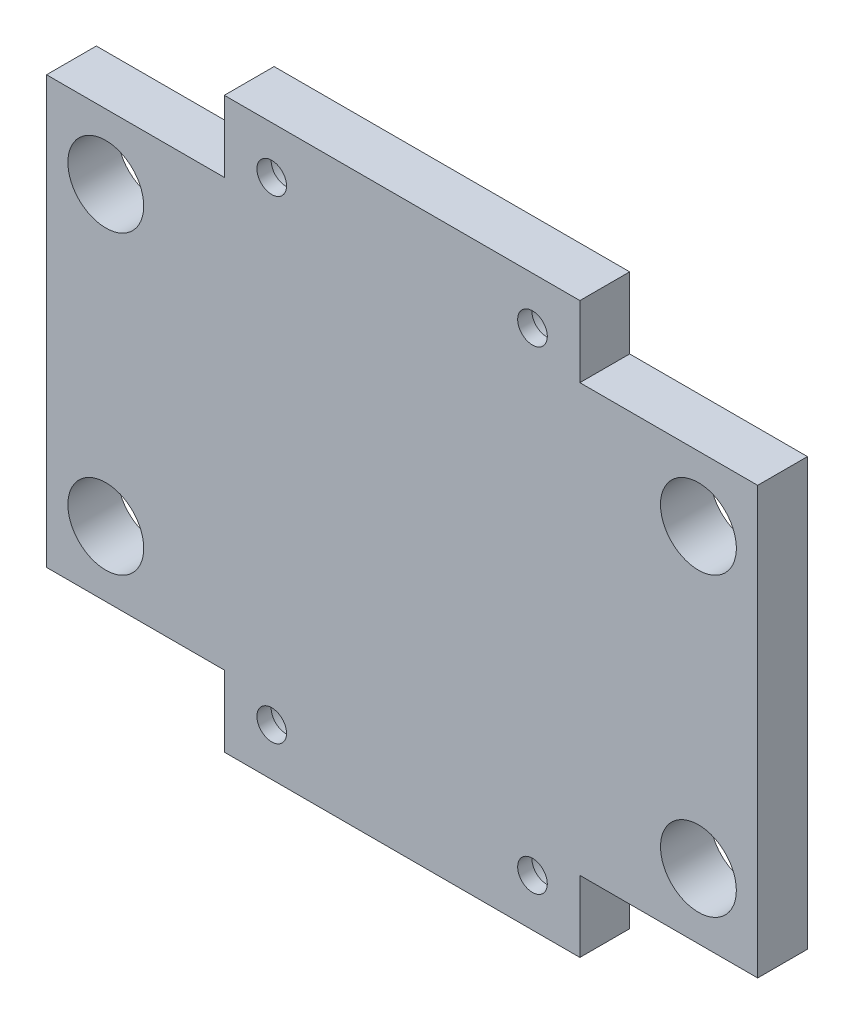
ISO-10303-21;
HEADER;
FILE_DESCRIPTION(('STEP AP214'),'2;1');
FILE_NAME('part.step','',(''),(''),'','','');
FILE_SCHEMA(('AUTOMOTIVE_DESIGN { 1 0 10303 214 1 1 1 1 }'));
ENDSEC;
DATA;
#1=APPLICATION_CONTEXT('core data for automotive mechanical design processes');
#2=APPLICATION_PROTOCOL_DEFINITION('international standard','automotive_design',2000,#1);
#3=PRODUCT_CONTEXT('',#1,'mechanical');
#4=PRODUCT('Part','Part','',(#3));
#5=PRODUCT_RELATED_PRODUCT_CATEGORY('part','',(#4));
#6=PRODUCT_DEFINITION_FORMATION('','',#4);
#7=PRODUCT_DEFINITION_CONTEXT('part definition',#1,'design');
#8=PRODUCT_DEFINITION('design','',#6,#7);
#9=PRODUCT_DEFINITION_SHAPE('','',#8);
#10=(LENGTH_UNIT() NAMED_UNIT(*) SI_UNIT(.MILLI.,.METRE.));
#11=(NAMED_UNIT(*) PLANE_ANGLE_UNIT() SI_UNIT($,.RADIAN.));
#12=(NAMED_UNIT(*) SI_UNIT($,.STERADIAN.) SOLID_ANGLE_UNIT());
#13=UNCERTAINTY_MEASURE_WITH_UNIT(LENGTH_MEASURE(1.E-05),#10,'distance_accuracy_value','');
#14=(GEOMETRIC_REPRESENTATION_CONTEXT(3) GLOBAL_UNCERTAINTY_ASSIGNED_CONTEXT((#13)) GLOBAL_UNIT_ASSIGNED_CONTEXT((#10,
#11,#12)) REPRESENTATION_CONTEXT('',''));
#15=CARTESIAN_POINT('',(0.,0.,0.));
#16=DIRECTION('',(0.,0.,1.));
#17=DIRECTION('',(1.,0.,0.));
#18=AXIS2_PLACEMENT_3D('',#15,#16,#17);
#19=CARTESIAN_POINT('',(-11.,20.,4.2));
#20=DIRECTION('',(0.,0.,-1.));
#21=DIRECTION('',(-1.,0.,0.));
#22=AXIS2_PLACEMENT_3D('',#19,#20,#21);
#23=CYLINDRICAL_SURFACE('',#22,1.25);
#24=CARTESIAN_POINT('',(-11.,20.,4.2));
#25=DIRECTION('',(0.,0.,1.));
#26=DIRECTION('',(1.,0.,0.));
#27=AXIS2_PLACEMENT_3D('',#24,#25,#26);
#28=CIRCLE('',#27,1.25);
#29=CARTESIAN_POINT('',(-9.75,20.,4.2));
#30=VERTEX_POINT('',#29);
#31=EDGE_CURVE('E254',#30,#30,#28,.T.);
#32=ORIENTED_EDGE('',*,*,#31,.T.);
#33=EDGE_LOOP('',(#32));
#34=FACE_BOUND('',#33,.T.);
#35=CARTESIAN_POINT('',(-11.,20.,3.));
#36=DIRECTION('',(0.,0.,-1.));
#37=DIRECTION('',(-1.,0.,0.));
#38=AXIS2_PLACEMENT_3D('',#35,#36,#37);
#39=CIRCLE('',#38,1.25);
#40=CARTESIAN_POINT('',(-12.25,20.,3.));
#41=VERTEX_POINT('',#40);
#42=EDGE_CURVE('E37',#41,#41,#39,.T.);
#43=ORIENTED_EDGE('',*,*,#42,.T.);
#44=EDGE_LOOP('',(#43));
#45=FACE_BOUND('',#44,.T.);
#46=ADVANCED_FACE('F33',(#34,#45),#23,.F.);
#47=CARTESIAN_POINT('',(-11.,-20.,4.2));
#48=DIRECTION('',(0.,0.,-1.));
#49=DIRECTION('',(-1.,0.,0.));
#50=AXIS2_PLACEMENT_3D('',#47,#48,#49);
#51=CYLINDRICAL_SURFACE('',#50,1.25);
#52=CARTESIAN_POINT('',(-11.,-20.,4.2));
#53=DIRECTION('',(0.,0.,1.));
#54=DIRECTION('',(-1.,0.,0.));
#55=AXIS2_PLACEMENT_3D('',#52,#53,#54);
#56=CIRCLE('',#55,1.25);
#57=CARTESIAN_POINT('',(-12.25,-20.,4.2));
#58=VERTEX_POINT('',#57);
#59=EDGE_CURVE('E249',#58,#58,#56,.T.);
#60=ORIENTED_EDGE('',*,*,#59,.T.);
#61=EDGE_LOOP('',(#60));
#62=FACE_BOUND('',#61,.T.);
#63=CARTESIAN_POINT('',(-11.,-20.,3.));
#64=DIRECTION('',(0.,0.,-1.));
#65=DIRECTION('',(-1.,0.,0.));
#66=AXIS2_PLACEMENT_3D('',#63,#64,#65);
#67=CIRCLE('',#66,1.25);
#68=CARTESIAN_POINT('',(-12.25,-20.,3.));
#69=VERTEX_POINT('',#68);
#70=EDGE_CURVE('E211',#69,#69,#67,.T.);
#71=ORIENTED_EDGE('',*,*,#70,.T.);
#72=EDGE_LOOP('',(#71));
#73=FACE_BOUND('',#72,.T.);
#74=ADVANCED_FACE('F307',(#62,#73),#51,.F.);
#75=CARTESIAN_POINT('',(11.,-20.,4.2));
#76=DIRECTION('',(0.,0.,-1.));
#77=DIRECTION('',(-1.,0.,0.));
#78=AXIS2_PLACEMENT_3D('',#75,#76,#77);
#79=CYLINDRICAL_SURFACE('',#78,1.25);
#80=CARTESIAN_POINT('',(11.,-20.,4.2));
#81=DIRECTION('',(0.,0.,1.));
#82=DIRECTION('',(1.,0.,0.));
#83=AXIS2_PLACEMENT_3D('',#80,#81,#82);
#84=CIRCLE('',#83,1.25);
#85=CARTESIAN_POINT('',(12.25,-20.,4.2));
#86=VERTEX_POINT('',#85);
#87=EDGE_CURVE('E236',#86,#86,#84,.T.);
#88=ORIENTED_EDGE('',*,*,#87,.T.);
#89=EDGE_LOOP('',(#88));
#90=FACE_BOUND('',#89,.T.);
#91=CARTESIAN_POINT('',(11.,-20.,3.));
#92=DIRECTION('',(0.,0.,-1.));
#93=DIRECTION('',(-1.,0.,0.));
#94=AXIS2_PLACEMENT_3D('',#91,#92,#93);
#95=CIRCLE('',#94,1.25);
#96=CARTESIAN_POINT('',(9.75,-20.,3.));
#97=VERTEX_POINT('',#96);
#98=EDGE_CURVE('E209',#97,#97,#95,.T.);
#99=ORIENTED_EDGE('',*,*,#98,.T.);
#100=EDGE_LOOP('',(#99));
#101=FACE_BOUND('',#100,.T.);
#102=ADVANCED_FACE('F313',(#90,#101),#79,.F.);
#103=CARTESIAN_POINT('',(11.,20.,4.2));
#104=DIRECTION('',(0.,0.,-1.));
#105=DIRECTION('',(-1.,0.,0.));
#106=AXIS2_PLACEMENT_3D('',#103,#104,#105);
#107=CYLINDRICAL_SURFACE('',#106,1.25);
#108=CARTESIAN_POINT('',(11.,20.,4.2));
#109=DIRECTION('',(0.,0.,1.));
#110=DIRECTION('',(-1.,0.,0.));
#111=AXIS2_PLACEMENT_3D('',#108,#109,#110);
#112=CIRCLE('',#111,1.25);
#113=CARTESIAN_POINT('',(9.75,20.,4.2));
#114=VERTEX_POINT('',#113);
#115=EDGE_CURVE('E231',#114,#114,#112,.T.);
#116=ORIENTED_EDGE('',*,*,#115,.T.);
#117=EDGE_LOOP('',(#116));
#118=FACE_BOUND('',#117,.T.);
#119=CARTESIAN_POINT('',(11.,20.,3.));
#120=DIRECTION('',(0.,0.,-1.));
#121=DIRECTION('',(-1.,0.,0.));
#122=AXIS2_PLACEMENT_3D('',#119,#120,#121);
#123=CIRCLE('',#122,1.25);
#124=CARTESIAN_POINT('',(9.75,20.,3.));
#125=VERTEX_POINT('',#124);
#126=EDGE_CURVE('E204',#125,#125,#123,.T.);
#127=ORIENTED_EDGE('',*,*,#126,.T.);
#128=EDGE_LOOP('',(#127));
#129=FACE_BOUND('',#128,.T.);
#130=ADVANCED_FACE('F319',(#118,#129),#107,.F.);
#131=CARTESIAN_POINT('',(0.,0.,4.2));
#132=DIRECTION('',(0.,0.,-1.));
#133=DIRECTION('',(-1.,0.,0.));
#134=AXIS2_PLACEMENT_3D('',#131,#132,#133);
#135=PLANE('',#134);
#136=DIRECTION('',(0.,-1.,0.));
#137=VECTOR('',#136,1.);
#138=CARTESIAN_POINT('',(-15.,24.,4.2));
#139=LINE('',#138,#137);
#140=CARTESIAN_POINT('',(-15.,24.,4.2));
#141=VERTEX_POINT('',#140);
#142=CARTESIAN_POINT('',(-15.,18.,4.2));
#143=VERTEX_POINT('',#142);
#144=EDGE_CURVE('E180',#141,#143,#139,.T.);
#145=ORIENTED_EDGE('',*,*,#144,.T.);
#146=DIRECTION('',(-1.,0.,0.));
#147=VECTOR('',#146,1.);
#148=CARTESIAN_POINT('',(-15.,18.,4.2));
#149=LINE('',#148,#147);
#150=CARTESIAN_POINT('',(-30.,18.,4.2));
#151=VERTEX_POINT('',#150);
#152=EDGE_CURVE('E107',#143,#151,#149,.T.);
#153=ORIENTED_EDGE('',*,*,#152,.T.);
#154=DIRECTION('',(0.,-1.,0.));
#155=VECTOR('',#154,1.);
#156=CARTESIAN_POINT('',(-30.,18.,4.2));
#157=LINE('',#156,#155);
#158=CARTESIAN_POINT('',(-30.,-18.,4.2));
#159=VERTEX_POINT('',#158);
#160=EDGE_CURVE('E264',#151,#159,#157,.T.);
#161=ORIENTED_EDGE('',*,*,#160,.T.);
#162=DIRECTION('',(1.,0.,0.));
#163=VECTOR('',#162,1.);
#164=CARTESIAN_POINT('',(-15.,-18.,4.2));
#165=LINE('',#164,#163);
#166=CARTESIAN_POINT('',(-15.,-18.,4.2));
#167=VERTEX_POINT('',#166);
#168=EDGE_CURVE('E266',#159,#167,#165,.T.);
#169=ORIENTED_EDGE('',*,*,#168,.T.);
#170=DIRECTION('',(0.,-1.,0.));
#171=VECTOR('',#170,1.);
#172=CARTESIAN_POINT('',(-15.,-24.,4.2));
#173=LINE('',#172,#171);
#174=CARTESIAN_POINT('',(-15.,-24.,4.2));
#175=VERTEX_POINT('',#174);
#176=EDGE_CURVE('E268',#167,#175,#173,.T.);
#177=ORIENTED_EDGE('',*,*,#176,.T.);
#178=DIRECTION('',(1.,0.,0.));
#179=VECTOR('',#178,1.);
#180=CARTESIAN_POINT('',(15.,-24.,4.2));
#181=LINE('',#180,#179);
#182=CARTESIAN_POINT('',(15.,-24.,4.2));
#183=VERTEX_POINT('',#182);
#184=EDGE_CURVE('E270',#175,#183,#181,.T.);
#185=ORIENTED_EDGE('',*,*,#184,.T.);
#186=DIRECTION('',(0.,1.,0.));
#187=VECTOR('',#186,1.);
#188=CARTESIAN_POINT('',(15.,-24.,4.2));
#189=LINE('',#188,#187);
#190=CARTESIAN_POINT('',(15.,-18.,4.2));
#191=VERTEX_POINT('',#190);
#192=EDGE_CURVE('E272',#183,#191,#189,.T.);
#193=ORIENTED_EDGE('',*,*,#192,.T.);
#194=DIRECTION('',(1.,0.,0.));
#195=VECTOR('',#194,1.);
#196=CARTESIAN_POINT('',(15.,-18.,4.2));
#197=LINE('',#196,#195);
#198=CARTESIAN_POINT('',(30.,-18.,4.2));
#199=VERTEX_POINT('',#198);
#200=EDGE_CURVE('E274',#191,#199,#197,.T.);
#201=ORIENTED_EDGE('',*,*,#200,.T.);
#202=DIRECTION('',(0.,1.,0.));
#203=VECTOR('',#202,1.);
#204=CARTESIAN_POINT('',(30.,18.,4.2));
#205=LINE('',#204,#203);
#206=CARTESIAN_POINT('',(30.,18.,4.2));
#207=VERTEX_POINT('',#206);
#208=EDGE_CURVE('E139',#199,#207,#205,.T.);
#209=ORIENTED_EDGE('',*,*,#208,.T.);
#210=DIRECTION('',(-1.,0.,0.));
#211=VECTOR('',#210,1.);
#212=CARTESIAN_POINT('',(15.,18.,4.2));
#213=LINE('',#212,#211);
#214=CARTESIAN_POINT('',(15.,18.,4.2));
#215=VERTEX_POINT('',#214);
#216=EDGE_CURVE('E132',#207,#215,#213,.T.);
#217=ORIENTED_EDGE('',*,*,#216,.T.);
#218=DIRECTION('',(0.,1.,0.));
#219=VECTOR('',#218,1.);
#220=CARTESIAN_POINT('',(15.,24.,4.2));
#221=LINE('',#220,#219);
#222=CARTESIAN_POINT('',(15.,24.,4.2));
#223=VERTEX_POINT('',#222);
#224=EDGE_CURVE('E137',#215,#223,#221,.T.);
#225=ORIENTED_EDGE('',*,*,#224,.T.);
#226=DIRECTION('',(-1.,0.,0.));
#227=VECTOR('',#226,1.);
#228=CARTESIAN_POINT('',(15.,24.,4.2));
#229=LINE('',#228,#227);
#230=EDGE_CURVE('E52',#223,#141,#229,.T.);
#231=ORIENTED_EDGE('',*,*,#230,.T.);
#232=EDGE_LOOP('',(#145,#153,#161,#169,#177,#185,#193,#201,#209,#217,#225,#231));
#233=FACE_BOUND('',#232,.T.);
#234=CARTESIAN_POINT('',(-25.,12.5,4.2));
#235=DIRECTION('',(0.,0.,1.));
#236=DIRECTION('',(1.,0.,0.));
#237=AXIS2_PLACEMENT_3D('',#234,#235,#236);
#238=CIRCLE('',#237,3.2);
#239=CARTESIAN_POINT('',(-21.8,12.5,4.2));
#240=VERTEX_POINT('',#239);
#241=EDGE_CURVE('E161',#240,#240,#238,.T.);
#242=ORIENTED_EDGE('',*,*,#241,.F.);
#243=EDGE_LOOP('',(#242));
#244=FACE_BOUND('',#243,.T.);
#245=ORIENTED_EDGE('',*,*,#31,.F.);
#246=EDGE_LOOP('',(#245));
#247=FACE_BOUND('',#246,.T.);
#248=ORIENTED_EDGE('',*,*,#59,.F.);
#249=EDGE_LOOP('',(#248));
#250=FACE_BOUND('',#249,.T.);
#251=CARTESIAN_POINT('',(-25.,-12.5,4.2));
#252=DIRECTION('',(0.,0.,1.));
#253=DIRECTION('',(-1.,0.,0.));
#254=AXIS2_PLACEMENT_3D('',#251,#252,#253);
#255=CIRCLE('',#254,3.2);
#256=CARTESIAN_POINT('',(-28.2,-12.5,4.2));
#257=VERTEX_POINT('',#256);
#258=EDGE_CURVE('E246',#257,#257,#255,.T.);
#259=ORIENTED_EDGE('',*,*,#258,.F.);
#260=EDGE_LOOP('',(#259));
#261=FACE_BOUND('',#260,.T.);
#262=CARTESIAN_POINT('',(25.,-12.5,4.2));
#263=DIRECTION('',(0.,0.,1.));
#264=DIRECTION('',(1.,0.,0.));
#265=AXIS2_PLACEMENT_3D('',#262,#263,#264);
#266=CIRCLE('',#265,3.2);
#267=CARTESIAN_POINT('',(28.2,-12.5,4.2));
#268=VERTEX_POINT('',#267);
#269=EDGE_CURVE('E240',#268,#268,#266,.T.);
#270=ORIENTED_EDGE('',*,*,#269,.F.);
#271=EDGE_LOOP('',(#270));
#272=FACE_BOUND('',#271,.T.);
#273=ORIENTED_EDGE('',*,*,#87,.F.);
#274=EDGE_LOOP('',(#273));
#275=FACE_BOUND('',#274,.T.);
#276=ORIENTED_EDGE('',*,*,#115,.F.);
#277=EDGE_LOOP('',(#276));
#278=FACE_BOUND('',#277,.T.);
#279=CARTESIAN_POINT('',(25.,12.5,4.2));
#280=DIRECTION('',(0.,0.,1.));
#281=DIRECTION('',(-1.,0.,0.));
#282=AXIS2_PLACEMENT_3D('',#279,#280,#281);
#283=CIRCLE('',#282,3.2);
#284=CARTESIAN_POINT('',(21.8,12.5,4.2));
#285=VERTEX_POINT('',#284);
#286=EDGE_CURVE('E228',#285,#285,#283,.T.);
#287=ORIENTED_EDGE('',*,*,#286,.F.);
#288=EDGE_LOOP('',(#287));
#289=FACE_BOUND('',#288,.T.);
#290=ADVANCED_FACE('F134',(#233,#244,#247,#250,#261,#272,#275,#278,#289),#135,.F.);
#291=CARTESIAN_POINT('',(0.,0.,0.));
#292=DIRECTION('',(0.,0.,-1.));
#293=DIRECTION('',(-1.,0.,0.));
#294=AXIS2_PLACEMENT_3D('',#291,#292,#293);
#295=PLANE('',#294);
#296=CARTESIAN_POINT('',(-11.,20.,0.));
#297=DIRECTION('',(0.,0.,-1.));
#298=DIRECTION('',(-1.,0.,0.));
#299=AXIS2_PLACEMENT_3D('',#296,#297,#298);
#300=CIRCLE('',#299,2.5);
#301=CARTESIAN_POINT('',(-13.5,20.,0.));
#302=VERTEX_POINT('',#301);
#303=EDGE_CURVE('E329',#302,#302,#300,.T.);
#304=ORIENTED_EDGE('',*,*,#303,.F.);
#305=EDGE_LOOP('',(#304));
#306=FACE_BOUND('',#305,.T.);
#307=CARTESIAN_POINT('',(-11.,-20.,0.));
#308=DIRECTION('',(0.,0.,-1.));
#309=DIRECTION('',(-1.,0.,0.));
#310=AXIS2_PLACEMENT_3D('',#307,#308,#309);
#311=CIRCLE('',#310,2.5);
#312=CARTESIAN_POINT('',(-13.5,-20.,0.));
#313=VERTEX_POINT('',#312);
#314=EDGE_CURVE('E333',#313,#313,#311,.T.);
#315=ORIENTED_EDGE('',*,*,#314,.F.);
#316=EDGE_LOOP('',(#315));
#317=FACE_BOUND('',#316,.T.);
#318=CARTESIAN_POINT('',(11.,-20.,0.));
#319=DIRECTION('',(0.,0.,-1.));
#320=DIRECTION('',(-1.,0.,0.));
#321=AXIS2_PLACEMENT_3D('',#318,#319,#320);
#322=CIRCLE('',#321,2.5);
#323=CARTESIAN_POINT('',(8.49999999999999,-20.,0.));
#324=VERTEX_POINT('',#323);
#325=EDGE_CURVE('E337',#324,#324,#322,.T.);
#326=ORIENTED_EDGE('',*,*,#325,.F.);
#327=EDGE_LOOP('',(#326));
#328=FACE_BOUND('',#327,.T.);
#329=CARTESIAN_POINT('',(11.,20.,0.));
#330=DIRECTION('',(0.,0.,-1.));
#331=DIRECTION('',(-1.,0.,0.));
#332=AXIS2_PLACEMENT_3D('',#329,#330,#331);
#333=CIRCLE('',#332,2.5);
#334=CARTESIAN_POINT('',(8.5,20.,0.));
#335=VERTEX_POINT('',#334);
#336=EDGE_CURVE('E217',#335,#335,#333,.T.);
#337=ORIENTED_EDGE('',*,*,#336,.F.);
#338=EDGE_LOOP('',(#337));
#339=FACE_BOUND('',#338,.T.);
#340=CARTESIAN_POINT('',(25.,-12.5,0.));
#341=DIRECTION('',(0.,0.,1.));
#342=DIRECTION('',(1.,0.,0.));
#343=AXIS2_PLACEMENT_3D('',#340,#341,#342);
#344=CIRCLE('',#343,3.2);
#345=CARTESIAN_POINT('',(28.2,-12.5,0.));
#346=VERTEX_POINT('',#345);
#347=EDGE_CURVE('E239',#346,#346,#344,.T.);
#348=ORIENTED_EDGE('',*,*,#347,.T.);
#349=EDGE_LOOP('',(#348));
#350=FACE_BOUND('',#349,.T.);
#351=CARTESIAN_POINT('',(-25.,12.5,0.));
#352=DIRECTION('',(0.,0.,1.));
#353=DIRECTION('',(1.,0.,0.));
#354=AXIS2_PLACEMENT_3D('',#351,#352,#353);
#355=CIRCLE('',#354,3.2);
#356=CARTESIAN_POINT('',(-21.8,12.5,0.));
#357=VERTEX_POINT('',#356);
#358=EDGE_CURVE('E257',#357,#357,#355,.T.);
#359=ORIENTED_EDGE('',*,*,#358,.T.);
#360=EDGE_LOOP('',(#359));
#361=FACE_BOUND('',#360,.T.);
#362=DIRECTION('',(0.,-1.,0.));
#363=VECTOR('',#362,1.);
#364=CARTESIAN_POINT('',(-15.,24.,0.));
#365=LINE('',#364,#363);
#366=CARTESIAN_POINT('',(-15.,24.,0.));
#367=VERTEX_POINT('',#366);
#368=CARTESIAN_POINT('',(-15.,18.,0.));
#369=VERTEX_POINT('',#368);
#370=EDGE_CURVE('E157',#367,#369,#365,.T.);
#371=ORIENTED_EDGE('',*,*,#370,.F.);
#372=DIRECTION('',(-1.,0.,0.));
#373=VECTOR('',#372,1.);
#374=CARTESIAN_POINT('',(15.,24.,0.));
#375=LINE('',#374,#373);
#376=CARTESIAN_POINT('',(15.,24.,0.));
#377=VERTEX_POINT('',#376);
#378=EDGE_CURVE('E99',#377,#367,#375,.T.);
#379=ORIENTED_EDGE('',*,*,#378,.F.);
#380=DIRECTION('',(0.,1.,0.));
#381=VECTOR('',#380,1.);
#382=CARTESIAN_POINT('',(15.,24.,0.));
#383=LINE('',#382,#381);
#384=CARTESIAN_POINT('',(15.,18.,0.));
#385=VERTEX_POINT('',#384);
#386=EDGE_CURVE('E93',#385,#377,#383,.T.);
#387=ORIENTED_EDGE('',*,*,#386,.F.);
#388=DIRECTION('',(-1.,0.,0.));
#389=VECTOR('',#388,1.);
#390=CARTESIAN_POINT('',(15.,18.,0.));
#391=LINE('',#390,#389);
#392=CARTESIAN_POINT('',(30.,18.,0.));
#393=VERTEX_POINT('',#392);
#394=EDGE_CURVE('E147',#393,#385,#391,.T.);
#395=ORIENTED_EDGE('',*,*,#394,.F.);
#396=DIRECTION('',(0.,1.,0.));
#397=VECTOR('',#396,1.);
#398=CARTESIAN_POINT('',(30.,18.,0.));
#399=LINE('',#398,#397);
#400=CARTESIAN_POINT('',(30.,-18.,0.));
#401=VERTEX_POINT('',#400);
#402=EDGE_CURVE('E175',#401,#393,#399,.T.);
#403=ORIENTED_EDGE('',*,*,#402,.F.);
#404=DIRECTION('',(1.,0.,0.));
#405=VECTOR('',#404,1.);
#406=CARTESIAN_POINT('',(15.,-18.,0.));
#407=LINE('',#406,#405);
#408=CARTESIAN_POINT('',(15.,-18.,0.));
#409=VERTEX_POINT('',#408);
#410=EDGE_CURVE('E173',#409,#401,#407,.T.);
#411=ORIENTED_EDGE('',*,*,#410,.F.);
#412=DIRECTION('',(0.,1.,0.));
#413=VECTOR('',#412,1.);
#414=CARTESIAN_POINT('',(15.,-24.,0.));
#415=LINE('',#414,#413);
#416=CARTESIAN_POINT('',(15.,-24.,0.));
#417=VERTEX_POINT('',#416);
#418=EDGE_CURVE('E171',#417,#409,#415,.T.);
#419=ORIENTED_EDGE('',*,*,#418,.F.);
#420=DIRECTION('',(1.,0.,0.));
#421=VECTOR('',#420,1.);
#422=CARTESIAN_POINT('',(15.,-24.,0.));
#423=LINE('',#422,#421);
#424=CARTESIAN_POINT('',(-15.,-24.,0.));
#425=VERTEX_POINT('',#424);
#426=EDGE_CURVE('E169',#425,#417,#423,.T.);
#427=ORIENTED_EDGE('',*,*,#426,.F.);
#428=DIRECTION('',(0.,-1.,0.));
#429=VECTOR('',#428,1.);
#430=CARTESIAN_POINT('',(-15.,-24.,0.));
#431=LINE('',#430,#429);
#432=CARTESIAN_POINT('',(-15.,-18.,0.));
#433=VERTEX_POINT('',#432);
#434=EDGE_CURVE('E167',#433,#425,#431,.T.);
#435=ORIENTED_EDGE('',*,*,#434,.F.);
#436=DIRECTION('',(1.,0.,0.));
#437=VECTOR('',#436,1.);
#438=CARTESIAN_POINT('',(-15.,-18.,0.));
#439=LINE('',#438,#437);
#440=CARTESIAN_POINT('',(-30.,-18.,0.));
#441=VERTEX_POINT('',#440);
#442=EDGE_CURVE('E165',#441,#433,#439,.T.);
#443=ORIENTED_EDGE('',*,*,#442,.F.);
#444=DIRECTION('',(0.,-1.,0.));
#445=VECTOR('',#444,1.);
#446=CARTESIAN_POINT('',(-30.,18.,0.));
#447=LINE('',#446,#445);
#448=CARTESIAN_POINT('',(-30.,18.,0.));
#449=VERTEX_POINT('',#448);
#450=EDGE_CURVE('E163',#449,#441,#447,.T.);
#451=ORIENTED_EDGE('',*,*,#450,.F.);
#452=DIRECTION('',(-1.,0.,0.));
#453=VECTOR('',#452,1.);
#454=CARTESIAN_POINT('',(-15.,18.,0.));
#455=LINE('',#454,#453);
#456=EDGE_CURVE('E160',#369,#449,#455,.T.);
#457=ORIENTED_EDGE('',*,*,#456,.F.);
#458=EDGE_LOOP('',(#371,#379,#387,#395,#403,#411,#419,#427,#435,#443,#451,#457));
#459=FACE_BOUND('',#458,.T.);
#460=CARTESIAN_POINT('',(-25.,-12.5,0.));
#461=DIRECTION('',(0.,0.,1.));
#462=DIRECTION('',(-1.,0.,0.));
#463=AXIS2_PLACEMENT_3D('',#460,#461,#462);
#464=CIRCLE('',#463,3.2);
#465=CARTESIAN_POINT('',(-28.2,-12.5,0.));
#466=VERTEX_POINT('',#465);
#467=EDGE_CURVE('E243',#466,#466,#464,.T.);
#468=ORIENTED_EDGE('',*,*,#467,.T.);
#469=EDGE_LOOP('',(#468));
#470=FACE_BOUND('',#469,.T.);
#471=CARTESIAN_POINT('',(25.,12.5,0.));
#472=DIRECTION('',(0.,0.,1.));
#473=DIRECTION('',(-1.,0.,0.));
#474=AXIS2_PLACEMENT_3D('',#471,#472,#473);
#475=CIRCLE('',#474,3.2);
#476=CARTESIAN_POINT('',(21.8,12.5,0.));
#477=VERTEX_POINT('',#476);
#478=EDGE_CURVE('E207',#477,#477,#475,.T.);
#479=ORIENTED_EDGE('',*,*,#478,.T.);
#480=EDGE_LOOP('',(#479));
#481=FACE_BOUND('',#480,.T.);
#482=ADVANCED_FACE('F287',(#306,#317,#328,#339,#350,#361,#459,#470,#481),#295,.T.);
#483=CARTESIAN_POINT('',(-15.,24.,4.2));
#484=DIRECTION('',(1.,0.,0.));
#485=DIRECTION('',(0.,0.,-1.));
#486=AXIS2_PLACEMENT_3D('',#483,#484,#485);
#487=PLANE('',#486);
#488=ORIENTED_EDGE('',*,*,#370,.T.);
#489=DIRECTION('',(0.,0.,-1.));
#490=VECTOR('',#489,1.);
#491=CARTESIAN_POINT('',(-15.,18.,4.2));
#492=LINE('',#491,#490);
#493=EDGE_CURVE('E11',#143,#369,#492,.T.);
#494=ORIENTED_EDGE('',*,*,#493,.F.);
#495=ORIENTED_EDGE('',*,*,#144,.F.);
#496=DIRECTION('',(0.,0.,-1.));
#497=VECTOR('',#496,1.);
#498=CARTESIAN_POINT('',(-15.,24.,4.2));
#499=LINE('',#498,#497);
#500=EDGE_CURVE('E153',#141,#367,#499,.T.);
#501=ORIENTED_EDGE('',*,*,#500,.T.);
#502=EDGE_LOOP('',(#488,#494,#495,#501));
#503=FACE_BOUND('',#502,.T.);
#504=ADVANCED_FACE('F35',(#503),#487,.F.);
#505=CARTESIAN_POINT('',(-15.,18.,4.2));
#506=DIRECTION('',(0.,-1.,0.));
#507=DIRECTION('',(0.,0.,-1.));
#508=AXIS2_PLACEMENT_3D('',#505,#506,#507);
#509=PLANE('',#508);
#510=ORIENTED_EDGE('',*,*,#456,.T.);
#511=DIRECTION('',(0.,0.,-1.));
#512=VECTOR('',#511,1.);
#513=CARTESIAN_POINT('',(-30.,18.,4.2));
#514=LINE('',#513,#512);
#515=EDGE_CURVE('E43',#151,#449,#514,.T.);
#516=ORIENTED_EDGE('',*,*,#515,.F.);
#517=ORIENTED_EDGE('',*,*,#152,.F.);
#518=ORIENTED_EDGE('',*,*,#493,.T.);
#519=EDGE_LOOP('',(#510,#516,#517,#518));
#520=FACE_BOUND('',#519,.T.);
#521=ADVANCED_FACE('F325',(#520),#509,.F.);
#522=CARTESIAN_POINT('',(-30.,18.,4.2));
#523=DIRECTION('',(1.,0.,0.));
#524=DIRECTION('',(0.,1.,0.));
#525=AXIS2_PLACEMENT_3D('',#522,#523,#524);
#526=PLANE('',#525);
#527=ORIENTED_EDGE('',*,*,#450,.T.);
#528=DIRECTION('',(0.,0.,-1.));
#529=VECTOR('',#528,1.);
#530=CARTESIAN_POINT('',(-30.,-18.,4.2));
#531=LINE('',#530,#529);
#532=EDGE_CURVE('E199',#159,#441,#531,.T.);
#533=ORIENTED_EDGE('',*,*,#532,.F.);
#534=ORIENTED_EDGE('',*,*,#160,.F.);
#535=ORIENTED_EDGE('',*,*,#515,.T.);
#536=EDGE_LOOP('',(#527,#533,#534,#535));
#537=FACE_BOUND('',#536,.T.);
#538=ADVANCED_FACE('F495',(#537),#526,.F.);
#539=CARTESIAN_POINT('',(-15.,-18.,4.2));
#540=DIRECTION('',(0.,1.,0.));
#541=DIRECTION('',(0.,0.,1.));
#542=AXIS2_PLACEMENT_3D('',#539,#540,#541);
#543=PLANE('',#542);
#544=ORIENTED_EDGE('',*,*,#442,.T.);
#545=DIRECTION('',(0.,0.,-1.));
#546=VECTOR('',#545,1.);
#547=CARTESIAN_POINT('',(-15.,-18.,4.2));
#548=LINE('',#547,#546);
#549=EDGE_CURVE('E196',#167,#433,#548,.T.);
#550=ORIENTED_EDGE('',*,*,#549,.F.);
#551=ORIENTED_EDGE('',*,*,#168,.F.);
#552=ORIENTED_EDGE('',*,*,#532,.T.);
#553=EDGE_LOOP('',(#544,#550,#551,#552));
#554=FACE_BOUND('',#553,.T.);
#555=ADVANCED_FACE('F502',(#554),#543,.F.);
#556=CARTESIAN_POINT('',(-15.,-24.,4.2));
#557=DIRECTION('',(1.,0.,0.));
#558=DIRECTION('',(0.,1.,0.));
#559=AXIS2_PLACEMENT_3D('',#556,#557,#558);
#560=PLANE('',#559);
#561=ORIENTED_EDGE('',*,*,#434,.T.);
#562=DIRECTION('',(0.,0.,-1.));
#563=VECTOR('',#562,1.);
#564=CARTESIAN_POINT('',(-15.,-24.,4.2));
#565=LINE('',#564,#563);
#566=EDGE_CURVE('E193',#175,#425,#565,.T.);
#567=ORIENTED_EDGE('',*,*,#566,.F.);
#568=ORIENTED_EDGE('',*,*,#176,.F.);
#569=ORIENTED_EDGE('',*,*,#549,.T.);
#570=EDGE_LOOP('',(#561,#567,#568,#569));
#571=FACE_BOUND('',#570,.T.);
#572=ADVANCED_FACE('F511',(#571),#560,.F.);
#573=CARTESIAN_POINT('',(15.,-24.,4.2));
#574=DIRECTION('',(0.,1.,0.));
#575=DIRECTION('',(0.,0.,1.));
#576=AXIS2_PLACEMENT_3D('',#573,#574,#575);
#577=PLANE('',#576);
#578=ORIENTED_EDGE('',*,*,#426,.T.);
#579=DIRECTION('',(0.,0.,-1.));
#580=VECTOR('',#579,1.);
#581=CARTESIAN_POINT('',(15.,-24.,4.2));
#582=LINE('',#581,#580);
#583=EDGE_CURVE('E190',#183,#417,#582,.T.);
#584=ORIENTED_EDGE('',*,*,#583,.F.);
#585=ORIENTED_EDGE('',*,*,#184,.F.);
#586=ORIENTED_EDGE('',*,*,#566,.T.);
#587=EDGE_LOOP('',(#578,#584,#585,#586));
#588=FACE_BOUND('',#587,.T.);
#589=ADVANCED_FACE('F520',(#588),#577,.F.);
#590=CARTESIAN_POINT('',(15.,-24.,4.2));
#591=DIRECTION('',(-1.,0.,0.));
#592=DIRECTION('',(0.,-1.,0.));
#593=AXIS2_PLACEMENT_3D('',#590,#591,#592);
#594=PLANE('',#593);
#595=ORIENTED_EDGE('',*,*,#418,.T.);
#596=DIRECTION('',(0.,0.,-1.));
#597=VECTOR('',#596,1.);
#598=CARTESIAN_POINT('',(15.,-18.,4.2));
#599=LINE('',#598,#597);
#600=EDGE_CURVE('E187',#191,#409,#599,.T.);
#601=ORIENTED_EDGE('',*,*,#600,.F.);
#602=ORIENTED_EDGE('',*,*,#192,.F.);
#603=ORIENTED_EDGE('',*,*,#583,.T.);
#604=EDGE_LOOP('',(#595,#601,#602,#603));
#605=FACE_BOUND('',#604,.T.);
#606=ADVANCED_FACE('F529',(#605),#594,.F.);
#607=CARTESIAN_POINT('',(15.,-18.,4.2));
#608=DIRECTION('',(0.,1.,0.));
#609=DIRECTION('',(0.,0.,1.));
#610=AXIS2_PLACEMENT_3D('',#607,#608,#609);
#611=PLANE('',#610);
#612=ORIENTED_EDGE('',*,*,#410,.T.);
#613=DIRECTION('',(0.,0.,-1.));
#614=VECTOR('',#613,1.);
#615=CARTESIAN_POINT('',(30.,-18.,4.2));
#616=LINE('',#615,#614);
#617=EDGE_CURVE('E184',#199,#401,#616,.T.);
#618=ORIENTED_EDGE('',*,*,#617,.F.);
#619=ORIENTED_EDGE('',*,*,#200,.F.);
#620=ORIENTED_EDGE('',*,*,#600,.T.);
#621=EDGE_LOOP('',(#612,#618,#619,#620));
#622=FACE_BOUND('',#621,.T.);
#623=ADVANCED_FACE('F280',(#622),#611,.F.);
#624=CARTESIAN_POINT('',(30.,18.,4.2));
#625=DIRECTION('',(-1.,0.,0.));
#626=DIRECTION('',(0.,-1.,0.));
#627=AXIS2_PLACEMENT_3D('',#624,#625,#626);
#628=PLANE('',#627);
#629=ORIENTED_EDGE('',*,*,#402,.T.);
#630=DIRECTION('',(0.,0.,-1.));
#631=VECTOR('',#630,1.);
#632=CARTESIAN_POINT('',(30.,18.,4.2));
#633=LINE('',#632,#631);
#634=EDGE_CURVE('E148',#207,#393,#633,.T.);
#635=ORIENTED_EDGE('',*,*,#634,.F.);
#636=ORIENTED_EDGE('',*,*,#208,.F.);
#637=ORIENTED_EDGE('',*,*,#617,.T.);
#638=EDGE_LOOP('',(#629,#635,#636,#637));
#639=FACE_BOUND('',#638,.T.);
#640=ADVANCED_FACE('F284',(#639),#628,.F.);
#641=CARTESIAN_POINT('',(15.,18.,4.2));
#642=DIRECTION('',(0.,-1.,0.));
#643=DIRECTION('',(0.,0.,-1.));
#644=AXIS2_PLACEMENT_3D('',#641,#642,#643);
#645=PLANE('',#644);
#646=ORIENTED_EDGE('',*,*,#394,.T.);
#647=DIRECTION('',(0.,0.,-1.));
#648=VECTOR('',#647,1.);
#649=CARTESIAN_POINT('',(15.,18.,4.2));
#650=LINE('',#649,#648);
#651=EDGE_CURVE('E144',#215,#385,#650,.T.);
#652=ORIENTED_EDGE('',*,*,#651,.F.);
#653=ORIENTED_EDGE('',*,*,#216,.F.);
#654=ORIENTED_EDGE('',*,*,#634,.T.);
#655=EDGE_LOOP('',(#646,#652,#653,#654));
#656=FACE_BOUND('',#655,.T.);
#657=ADVANCED_FACE('F145',(#656),#645,.F.);
#658=CARTESIAN_POINT('',(15.,24.,4.2));
#659=DIRECTION('',(-1.,0.,0.));
#660=DIRECTION('',(0.,0.,1.));
#661=AXIS2_PLACEMENT_3D('',#658,#659,#660);
#662=PLANE('',#661);
#663=ORIENTED_EDGE('',*,*,#386,.T.);
#664=DIRECTION('',(0.,0.,-1.));
#665=VECTOR('',#664,1.);
#666=CARTESIAN_POINT('',(15.,24.,4.2));
#667=LINE('',#666,#665);
#668=EDGE_CURVE('E149',#223,#377,#667,.T.);
#669=ORIENTED_EDGE('',*,*,#668,.F.);
#670=ORIENTED_EDGE('',*,*,#224,.F.);
#671=ORIENTED_EDGE('',*,*,#651,.T.);
#672=EDGE_LOOP('',(#663,#669,#670,#671));
#673=FACE_BOUND('',#672,.T.);
#674=ADVANCED_FACE('F151',(#673),#662,.F.);
#675=CARTESIAN_POINT('',(15.,24.,4.2));
#676=DIRECTION('',(0.,-1.,0.));
#677=DIRECTION('',(0.,0.,-1.));
#678=AXIS2_PLACEMENT_3D('',#675,#676,#677);
#679=PLANE('',#678);
#680=ORIENTED_EDGE('',*,*,#378,.T.);
#681=ORIENTED_EDGE('',*,*,#500,.F.);
#682=ORIENTED_EDGE('',*,*,#230,.F.);
#683=ORIENTED_EDGE('',*,*,#668,.T.);
#684=EDGE_LOOP('',(#680,#681,#682,#683));
#685=FACE_BOUND('',#684,.T.);
#686=ADVANCED_FACE('F293',(#685),#679,.F.);
#687=CARTESIAN_POINT('',(-25.,12.5,4.2));
#688=DIRECTION('',(0.,0.,-1.));
#689=DIRECTION('',(-1.,0.,0.));
#690=AXIS2_PLACEMENT_3D('',#687,#688,#689);
#691=CYLINDRICAL_SURFACE('',#690,3.2);
#692=ORIENTED_EDGE('',*,*,#241,.T.);
#693=EDGE_LOOP('',(#692));
#694=FACE_BOUND('',#693,.T.);
#695=ORIENTED_EDGE('',*,*,#358,.F.);
#696=EDGE_LOOP('',(#695));
#697=FACE_BOUND('',#696,.T.);
#698=ADVANCED_FACE('F295',(#694,#697),#691,.F.);
#699=CARTESIAN_POINT('',(-25.,-12.5,4.2));
#700=DIRECTION('',(0.,0.,-1.));
#701=DIRECTION('',(-1.,0.,0.));
#702=AXIS2_PLACEMENT_3D('',#699,#700,#701);
#703=CYLINDRICAL_SURFACE('',#702,3.2);
#704=ORIENTED_EDGE('',*,*,#258,.T.);
#705=EDGE_LOOP('',(#704));
#706=FACE_BOUND('',#705,.T.);
#707=ORIENTED_EDGE('',*,*,#467,.F.);
#708=EDGE_LOOP('',(#707));
#709=FACE_BOUND('',#708,.T.);
#710=ADVANCED_FACE('F301',(#706,#709),#703,.F.);
#711=CARTESIAN_POINT('',(25.,-12.5,4.2));
#712=DIRECTION('',(0.,0.,-1.));
#713=DIRECTION('',(-1.,0.,0.));
#714=AXIS2_PLACEMENT_3D('',#711,#712,#713);
#715=CYLINDRICAL_SURFACE('',#714,3.2);
#716=ORIENTED_EDGE('',*,*,#269,.T.);
#717=EDGE_LOOP('',(#716));
#718=FACE_BOUND('',#717,.T.);
#719=ORIENTED_EDGE('',*,*,#347,.F.);
#720=EDGE_LOOP('',(#719));
#721=FACE_BOUND('',#720,.T.);
#722=ADVANCED_FACE('F344',(#718,#721),#715,.F.);
#723=CARTESIAN_POINT('',(25.,12.5,4.2));
#724=DIRECTION('',(0.,0.,-1.));
#725=DIRECTION('',(-1.,0.,0.));
#726=AXIS2_PLACEMENT_3D('',#723,#724,#725);
#727=CYLINDRICAL_SURFACE('',#726,3.2);
#728=ORIENTED_EDGE('',*,*,#286,.T.);
#729=EDGE_LOOP('',(#728));
#730=FACE_BOUND('',#729,.T.);
#731=ORIENTED_EDGE('',*,*,#478,.F.);
#732=EDGE_LOOP('',(#731));
#733=FACE_BOUND('',#732,.T.);
#734=ADVANCED_FACE('F346',(#730,#733),#727,.F.);
#735=CARTESIAN_POINT('',(11.,20.,3.));
#736=DIRECTION('',(0.,0.,-1.));
#737=DIRECTION('',(-1.,0.,0.));
#738=AXIS2_PLACEMENT_3D('',#735,#736,#737);
#739=CYLINDRICAL_SURFACE('',#738,2.5);
#740=CARTESIAN_POINT('',(11.,20.,3.));
#741=DIRECTION('',(0.,0.,-1.));
#742=DIRECTION('',(-1.,0.,0.));
#743=AXIS2_PLACEMENT_3D('',#740,#741,#742);
#744=CIRCLE('',#743,2.5);
#745=CARTESIAN_POINT('',(8.5,20.,3.));
#746=VERTEX_POINT('',#745);
#747=EDGE_CURVE('E208',#746,#746,#744,.T.);
#748=ORIENTED_EDGE('',*,*,#747,.F.);
#749=EDGE_LOOP('',(#748));
#750=FACE_BOUND('',#749,.T.);
#751=ORIENTED_EDGE('',*,*,#336,.T.);
#752=EDGE_LOOP('',(#751));
#753=FACE_BOUND('',#752,.T.);
#754=ADVANCED_FACE('F353',(#750,#753),#739,.F.);
#755=CARTESIAN_POINT('',(11.,20.,3.));
#756=DIRECTION('',(0.,0.,-1.));
#757=DIRECTION('',(-1.,0.,0.));
#758=AXIS2_PLACEMENT_3D('',#755,#756,#757);
#759=PLANE('',#758);
#760=ORIENTED_EDGE('',*,*,#126,.F.);
#761=EDGE_LOOP('',(#760));
#762=FACE_BOUND('',#761,.T.);
#763=ORIENTED_EDGE('',*,*,#747,.T.);
#764=EDGE_LOOP('',(#763));
#765=FACE_BOUND('',#764,.T.);
#766=ADVANCED_FACE('F366',(#762,#765),#759,.T.);
#767=CARTESIAN_POINT('',(11.,-20.,3.));
#768=DIRECTION('',(0.,0.,-1.));
#769=DIRECTION('',(-1.,0.,0.));
#770=AXIS2_PLACEMENT_3D('',#767,#768,#769);
#771=CYLINDRICAL_SURFACE('',#770,2.5);
#772=CARTESIAN_POINT('',(11.,-20.,3.));
#773=DIRECTION('',(0.,0.,-1.));
#774=DIRECTION('',(-1.,0.,0.));
#775=AXIS2_PLACEMENT_3D('',#772,#773,#774);
#776=CIRCLE('',#775,2.5);
#777=CARTESIAN_POINT('',(8.49999999999999,-20.,3.));
#778=VERTEX_POINT('',#777);
#779=EDGE_CURVE('E406',#778,#778,#776,.T.);
#780=ORIENTED_EDGE('',*,*,#779,.F.);
#781=EDGE_LOOP('',(#780));
#782=FACE_BOUND('',#781,.T.);
#783=ORIENTED_EDGE('',*,*,#325,.T.);
#784=EDGE_LOOP('',(#783));
#785=FACE_BOUND('',#784,.T.);
#786=ADVANCED_FACE('F370',(#782,#785),#771,.F.);
#787=CARTESIAN_POINT('',(11.,-20.,3.));
#788=DIRECTION('',(0.,0.,-1.));
#789=DIRECTION('',(-1.,0.,0.));
#790=AXIS2_PLACEMENT_3D('',#787,#788,#789);
#791=PLANE('',#790);
#792=ORIENTED_EDGE('',*,*,#98,.F.);
#793=EDGE_LOOP('',(#792));
#794=FACE_BOUND('',#793,.T.);
#795=ORIENTED_EDGE('',*,*,#779,.T.);
#796=EDGE_LOOP('',(#795));
#797=FACE_BOUND('',#796,.T.);
#798=ADVANCED_FACE('F374',(#794,#797),#791,.T.);
#799=CARTESIAN_POINT('',(-11.,-20.,3.));
#800=DIRECTION('',(0.,0.,-1.));
#801=DIRECTION('',(-1.,0.,0.));
#802=AXIS2_PLACEMENT_3D('',#799,#800,#801);
#803=CYLINDRICAL_SURFACE('',#802,2.5);
#804=CARTESIAN_POINT('',(-11.,-20.,3.));
#805=DIRECTION('',(0.,0.,-1.));
#806=DIRECTION('',(-1.,0.,0.));
#807=AXIS2_PLACEMENT_3D('',#804,#805,#806);
#808=CIRCLE('',#807,2.5);
#809=CARTESIAN_POINT('',(-13.5,-20.,3.));
#810=VERTEX_POINT('',#809);
#811=EDGE_CURVE('E400',#810,#810,#808,.T.);
#812=ORIENTED_EDGE('',*,*,#811,.F.);
#813=EDGE_LOOP('',(#812));
#814=FACE_BOUND('',#813,.T.);
#815=ORIENTED_EDGE('',*,*,#314,.T.);
#816=EDGE_LOOP('',(#815));
#817=FACE_BOUND('',#816,.T.);
#818=ADVANCED_FACE('F378',(#814,#817),#803,.F.);
#819=CARTESIAN_POINT('',(-11.,-20.,3.));
#820=DIRECTION('',(0.,0.,-1.));
#821=DIRECTION('',(-1.,0.,0.));
#822=AXIS2_PLACEMENT_3D('',#819,#820,#821);
#823=PLANE('',#822);
#824=ORIENTED_EDGE('',*,*,#70,.F.);
#825=EDGE_LOOP('',(#824));
#826=FACE_BOUND('',#825,.T.);
#827=ORIENTED_EDGE('',*,*,#811,.T.);
#828=EDGE_LOOP('',(#827));
#829=FACE_BOUND('',#828,.T.);
#830=ADVANCED_FACE('F382',(#826,#829),#823,.T.);
#831=CARTESIAN_POINT('',(-11.,20.,3.));
#832=DIRECTION('',(0.,0.,-1.));
#833=DIRECTION('',(-1.,0.,0.));
#834=AXIS2_PLACEMENT_3D('',#831,#832,#833);
#835=CYLINDRICAL_SURFACE('',#834,2.5);
#836=CARTESIAN_POINT('',(-11.,20.,3.));
#837=DIRECTION('',(0.,0.,-1.));
#838=DIRECTION('',(-1.,0.,0.));
#839=AXIS2_PLACEMENT_3D('',#836,#837,#838);
#840=CIRCLE('',#839,2.5);
#841=CARTESIAN_POINT('',(-13.5,20.,3.));
#842=VERTEX_POINT('',#841);
#843=EDGE_CURVE('E212',#842,#842,#840,.T.);
#844=ORIENTED_EDGE('',*,*,#843,.F.);
#845=EDGE_LOOP('',(#844));
#846=FACE_BOUND('',#845,.T.);
#847=ORIENTED_EDGE('',*,*,#303,.T.);
#848=EDGE_LOOP('',(#847));
#849=FACE_BOUND('',#848,.T.);
#850=ADVANCED_FACE('F386',(#846,#849),#835,.F.);
#851=CARTESIAN_POINT('',(-11.,20.,3.));
#852=DIRECTION('',(0.,0.,-1.));
#853=DIRECTION('',(-1.,0.,0.));
#854=AXIS2_PLACEMENT_3D('',#851,#852,#853);
#855=PLANE('',#854);
#856=ORIENTED_EDGE('',*,*,#42,.F.);
#857=EDGE_LOOP('',(#856));
#858=FACE_BOUND('',#857,.T.);
#859=ORIENTED_EDGE('',*,*,#843,.T.);
#860=EDGE_LOOP('',(#859));
#861=FACE_BOUND('',#860,.T.);
#862=ADVANCED_FACE('F390',(#858,#861),#855,.T.);
#863=CLOSED_SHELL('',(#46,#74,#102,#130,#290,#482,#504,#521,#538,#555,#572,#589,#606,#623,#640,
#657,#674,#686,#698,#710,#722,#734,#754,#766,#786,#798,#818,#830,#850,#862));
#864=MANIFOLD_SOLID_BREP('B2',#863);
#865=ADVANCED_BREP_SHAPE_REPRESENTATION('',(#18,#864),#14);
#866=SHAPE_DEFINITION_REPRESENTATION(#9,#865);
ENDSEC;
END-ISO-10303-21;
